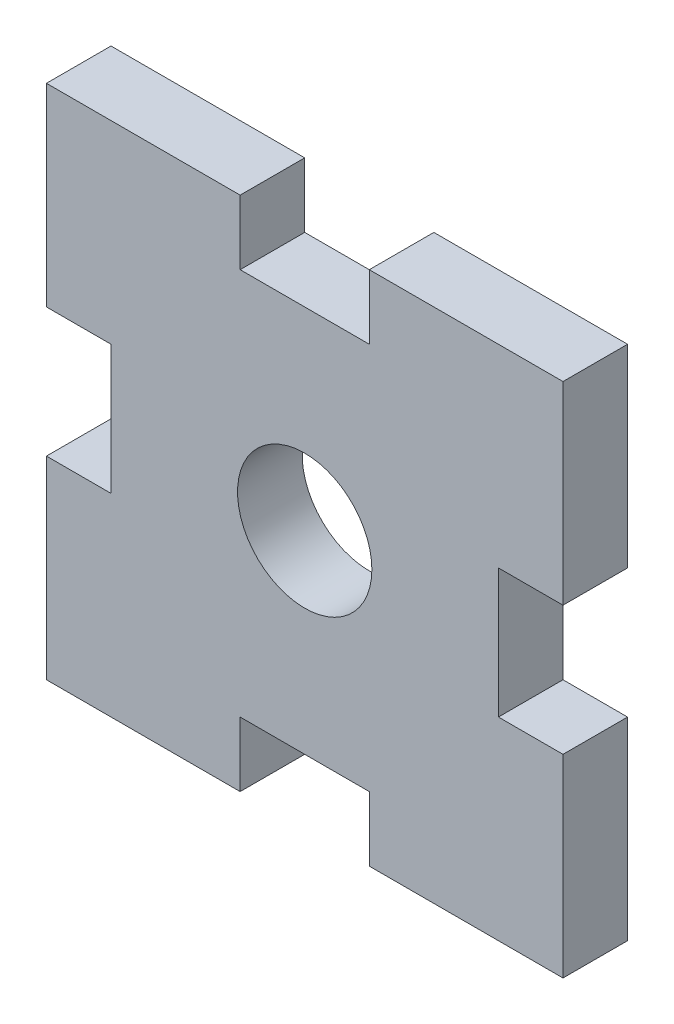
ISO-10303-21;
HEADER;
FILE_DESCRIPTION(('STEP AP214'),'2;1');
FILE_NAME('part.step','',(''),(''),'','','');
FILE_SCHEMA(('AUTOMOTIVE_DESIGN { 1 0 10303 214 1 1 1 1 }'));
ENDSEC;
DATA;
#1=APPLICATION_CONTEXT('core data for automotive mechanical design processes');
#2=APPLICATION_PROTOCOL_DEFINITION('international standard','automotive_design',2000,#1);
#3=PRODUCT_CONTEXT('',#1,'mechanical');
#4=PRODUCT('Part','Part','',(#3));
#5=PRODUCT_RELATED_PRODUCT_CATEGORY('part','',(#4));
#6=PRODUCT_DEFINITION_FORMATION('','',#4);
#7=PRODUCT_DEFINITION_CONTEXT('part definition',#1,'design');
#8=PRODUCT_DEFINITION('design','',#6,#7);
#9=PRODUCT_DEFINITION_SHAPE('','',#8);
#10=(LENGTH_UNIT() NAMED_UNIT(*) SI_UNIT(.MILLI.,.METRE.));
#11=(NAMED_UNIT(*) PLANE_ANGLE_UNIT() SI_UNIT($,.RADIAN.));
#12=(NAMED_UNIT(*) SI_UNIT($,.STERADIAN.) SOLID_ANGLE_UNIT());
#13=UNCERTAINTY_MEASURE_WITH_UNIT(LENGTH_MEASURE(1.E-05),#10,'distance_accuracy_value','');
#14=(GEOMETRIC_REPRESENTATION_CONTEXT(3) GLOBAL_UNCERTAINTY_ASSIGNED_CONTEXT((#13)) GLOBAL_UNIT_ASSIGNED_CONTEXT((#10,
#11,#12)) REPRESENTATION_CONTEXT('',''));
#15=CARTESIAN_POINT('',(0.,0.,0.));
#16=DIRECTION('',(0.,0.,1.));
#17=DIRECTION('',(1.,0.,0.));
#18=AXIS2_PLACEMENT_3D('',#15,#16,#17);
#19=CARTESIAN_POINT('',(-12.7,9.525,3.175));
#20=DIRECTION('',(0.,0.,1.));
#21=DIRECTION('',(1.,0.,0.));
#22=AXIS2_PLACEMENT_3D('',#19,#20,#21);
#23=PLANE('',#22);
#24=DIRECTION('',(0.,-1.,0.));
#25=VECTOR('',#24,1.);
#26=CARTESIAN_POINT('',(-12.7,12.7,3.175));
#27=LINE('',#26,#25);
#28=CARTESIAN_POINT('',(-12.7,12.7,3.175));
#29=VERTEX_POINT('',#28);
#30=CARTESIAN_POINT('',(-12.7,3.175,3.175));
#31=VERTEX_POINT('',#30);
#32=EDGE_CURVE('E241',#29,#31,#27,.T.);
#33=ORIENTED_EDGE('',*,*,#32,.T.);
#34=DIRECTION('',(1.,0.,0.));
#35=VECTOR('',#34,1.);
#36=CARTESIAN_POINT('',(-12.7,3.175,3.175));
#37=LINE('',#36,#35);
#38=CARTESIAN_POINT('',(-9.525,3.175,3.175));
#39=VERTEX_POINT('',#38);
#40=EDGE_CURVE('E129',#31,#39,#37,.T.);
#41=ORIENTED_EDGE('',*,*,#40,.T.);
#42=DIRECTION('',(0.,-1.,0.));
#43=VECTOR('',#42,1.);
#44=CARTESIAN_POINT('',(-9.525,3.175,3.175));
#45=LINE('',#44,#43);
#46=CARTESIAN_POINT('',(-9.525,-3.175,3.175));
#47=VERTEX_POINT('',#46);
#48=EDGE_CURVE('E292',#39,#47,#45,.T.);
#49=ORIENTED_EDGE('',*,*,#48,.T.);
#50=DIRECTION('',(-1.,0.,0.));
#51=VECTOR('',#50,1.);
#52=CARTESIAN_POINT('',(-9.525,-3.175,3.175));
#53=LINE('',#52,#51);
#54=CARTESIAN_POINT('',(-12.7,-3.17500000000001,3.175));
#55=VERTEX_POINT('',#54);
#56=EDGE_CURVE('E311',#47,#55,#53,.T.);
#57=ORIENTED_EDGE('',*,*,#56,.T.);
#58=DIRECTION('',(0.,-1.,0.));
#59=VECTOR('',#58,1.);
#60=CARTESIAN_POINT('',(-12.7,-3.17500000000001,3.175));
#61=LINE('',#60,#59);
#62=CARTESIAN_POINT('',(-12.7,-12.7,3.175));
#63=VERTEX_POINT('',#62);
#64=EDGE_CURVE('E308',#55,#63,#61,.T.);
#65=ORIENTED_EDGE('',*,*,#64,.T.);
#66=DIRECTION('',(1.,0.,0.));
#67=VECTOR('',#66,1.);
#68=CARTESIAN_POINT('',(-12.7,-12.7,3.175));
#69=LINE('',#68,#67);
#70=CARTESIAN_POINT('',(-3.17499999999999,-12.7,3.175));
#71=VERTEX_POINT('',#70);
#72=EDGE_CURVE('E310',#63,#71,#69,.T.);
#73=ORIENTED_EDGE('',*,*,#72,.T.);
#74=DIRECTION('',(0.,1.,0.));
#75=VECTOR('',#74,1.);
#76=CARTESIAN_POINT('',(-3.17499999999999,-12.7,3.175));
#77=LINE('',#76,#75);
#78=CARTESIAN_POINT('',(-3.17499999999999,-9.525,3.175));
#79=VERTEX_POINT('',#78);
#80=EDGE_CURVE('E313',#71,#79,#77,.T.);
#81=ORIENTED_EDGE('',*,*,#80,.T.);
#82=DIRECTION('',(1.,0.,0.));
#83=VECTOR('',#82,1.);
#84=CARTESIAN_POINT('',(-3.17499999999999,-9.525,3.175));
#85=LINE('',#84,#83);
#86=CARTESIAN_POINT('',(3.17500000000001,-9.525,3.175));
#87=VERTEX_POINT('',#86);
#88=EDGE_CURVE('E319',#79,#87,#85,.T.);
#89=ORIENTED_EDGE('',*,*,#88,.T.);
#90=DIRECTION('',(0.,-1.,0.));
#91=VECTOR('',#90,1.);
#92=CARTESIAN_POINT('',(3.17500000000001,-9.525,3.175));
#93=LINE('',#92,#91);
#94=CARTESIAN_POINT('',(3.17500000000001,-12.7,3.175));
#95=VERTEX_POINT('',#94);
#96=EDGE_CURVE('E321',#87,#95,#93,.T.);
#97=ORIENTED_EDGE('',*,*,#96,.T.);
#98=DIRECTION('',(1.,0.,0.));
#99=VECTOR('',#98,1.);
#100=CARTESIAN_POINT('',(3.17500000000001,-12.7,3.175));
#101=LINE('',#100,#99);
#102=CARTESIAN_POINT('',(12.7,-12.7,3.175));
#103=VERTEX_POINT('',#102);
#104=EDGE_CURVE('E323',#95,#103,#101,.T.);
#105=ORIENTED_EDGE('',*,*,#104,.T.);
#106=DIRECTION('',(0.,1.,0.));
#107=VECTOR('',#106,1.);
#108=CARTESIAN_POINT('',(12.7,-12.7,3.175));
#109=LINE('',#108,#107);
#110=CARTESIAN_POINT('',(12.7,-3.175,3.175));
#111=VERTEX_POINT('',#110);
#112=EDGE_CURVE('E325',#103,#111,#109,.T.);
#113=ORIENTED_EDGE('',*,*,#112,.T.);
#114=DIRECTION('',(-1.,0.,0.));
#115=VECTOR('',#114,1.);
#116=CARTESIAN_POINT('',(9.52499999999999,-3.175,3.175));
#117=LINE('',#116,#115);
#118=CARTESIAN_POINT('',(9.52499999999999,-3.175,3.175));
#119=VERTEX_POINT('',#118);
#120=EDGE_CURVE('E327',#111,#119,#117,.T.);
#121=ORIENTED_EDGE('',*,*,#120,.T.);
#122=DIRECTION('',(0.,1.,0.));
#123=VECTOR('',#122,1.);
#124=CARTESIAN_POINT('',(9.52499999999999,3.175,3.175));
#125=LINE('',#124,#123);
#126=CARTESIAN_POINT('',(9.52499999999999,3.175,3.175));
#127=VERTEX_POINT('',#126);
#128=EDGE_CURVE('E329',#119,#127,#125,.T.);
#129=ORIENTED_EDGE('',*,*,#128,.T.);
#130=DIRECTION('',(1.,0.,0.));
#131=VECTOR('',#130,1.);
#132=CARTESIAN_POINT('',(12.7,3.175,3.175));
#133=LINE('',#132,#131);
#134=CARTESIAN_POINT('',(12.7,3.175,3.175));
#135=VERTEX_POINT('',#134);
#136=EDGE_CURVE('E331',#127,#135,#133,.T.);
#137=ORIENTED_EDGE('',*,*,#136,.T.);
#138=DIRECTION('',(0.,1.,0.));
#139=VECTOR('',#138,1.);
#140=CARTESIAN_POINT('',(12.7,12.7,3.175));
#141=LINE('',#140,#139);
#142=CARTESIAN_POINT('',(12.7,12.7,3.175));
#143=VERTEX_POINT('',#142);
#144=EDGE_CURVE('E333',#135,#143,#141,.T.);
#145=ORIENTED_EDGE('',*,*,#144,.T.);
#146=DIRECTION('',(-1.,0.,0.));
#147=VECTOR('',#146,1.);
#148=CARTESIAN_POINT('',(12.7,12.7,3.175));
#149=LINE('',#148,#147);
#150=CARTESIAN_POINT('',(3.175,12.7,3.175));
#151=VERTEX_POINT('',#150);
#152=EDGE_CURVE('E335',#143,#151,#149,.T.);
#153=ORIENTED_EDGE('',*,*,#152,.T.);
#154=DIRECTION('',(0.,-1.,0.));
#155=VECTOR('',#154,1.);
#156=CARTESIAN_POINT('',(3.175,9.525,3.175));
#157=LINE('',#156,#155);
#158=CARTESIAN_POINT('',(3.175,9.525,3.175));
#159=VERTEX_POINT('',#158);
#160=EDGE_CURVE('E184',#151,#159,#157,.T.);
#161=ORIENTED_EDGE('',*,*,#160,.T.);
#162=DIRECTION('',(-1.,0.,0.));
#163=VECTOR('',#162,1.);
#164=CARTESIAN_POINT('',(-3.175,9.525,3.175));
#165=LINE('',#164,#163);
#166=CARTESIAN_POINT('',(-3.175,9.525,3.175));
#167=VERTEX_POINT('',#166);
#168=EDGE_CURVE('E178',#159,#167,#165,.T.);
#169=ORIENTED_EDGE('',*,*,#168,.T.);
#170=DIRECTION('',(0.,1.,0.));
#171=VECTOR('',#170,1.);
#172=CARTESIAN_POINT('',(-3.175,12.7,3.175));
#173=LINE('',#172,#171);
#174=CARTESIAN_POINT('',(-3.175,12.7,3.175));
#175=VERTEX_POINT('',#174);
#176=EDGE_CURVE('E182',#167,#175,#173,.T.);
#177=ORIENTED_EDGE('',*,*,#176,.T.);
#178=DIRECTION('',(-1.,0.,0.));
#179=VECTOR('',#178,1.);
#180=CARTESIAN_POINT('',(-12.7,12.7,3.175));
#181=LINE('',#180,#179);
#182=EDGE_CURVE('E50',#175,#29,#181,.T.);
#183=ORIENTED_EDGE('',*,*,#182,.T.);
#184=EDGE_LOOP('',(#33,#41,#49,#57,#65,#73,#81,#89,#97,#105,#113,#121,#129,#137,#145,#153,#161,
#169,#177,#183));
#185=FACE_BOUND('',#184,.T.);
#186=CARTESIAN_POINT('',(0.,0.,3.175));
#187=DIRECTION('',(0.,0.,1.));
#188=DIRECTION('',(1.,0.,0.));
#189=AXIS2_PLACEMENT_3D('',#186,#187,#188);
#190=CIRCLE('',#189,3.302);
#191=CARTESIAN_POINT('',(3.302,0.,3.175));
#192=VERTEX_POINT('',#191);
#193=EDGE_CURVE('E206',#192,#192,#190,.T.);
#194=ORIENTED_EDGE('',*,*,#193,.F.);
#195=EDGE_LOOP('',(#194));
#196=FACE_BOUND('',#195,.T.);
#197=ADVANCED_FACE('F33',(#185,#196),#23,.T.);
#198=CARTESIAN_POINT('',(-12.7,9.525,0.));
#199=DIRECTION('',(0.,0.,1.));
#200=DIRECTION('',(1.,0.,0.));
#201=AXIS2_PLACEMENT_3D('',#198,#199,#200);
#202=PLANE('',#201);
#203=DIRECTION('',(0.,-1.,0.));
#204=VECTOR('',#203,1.);
#205=CARTESIAN_POINT('',(-12.7,12.7,0.));
#206=LINE('',#205,#204);
#207=CARTESIAN_POINT('',(-12.7,12.7,0.));
#208=VERTEX_POINT('',#207);
#209=CARTESIAN_POINT('',(-12.7,3.175,0.));
#210=VERTEX_POINT('',#209);
#211=EDGE_CURVE('E202',#208,#210,#206,.T.);
#212=ORIENTED_EDGE('',*,*,#211,.F.);
#213=DIRECTION('',(-1.,0.,0.));
#214=VECTOR('',#213,1.);
#215=CARTESIAN_POINT('',(-12.7,12.7,0.));
#216=LINE('',#215,#214);
#217=CARTESIAN_POINT('',(-3.175,12.7,0.));
#218=VERTEX_POINT('',#217);
#219=EDGE_CURVE('E121',#218,#208,#216,.T.);
#220=ORIENTED_EDGE('',*,*,#219,.F.);
#221=DIRECTION('',(0.,1.,0.));
#222=VECTOR('',#221,1.);
#223=CARTESIAN_POINT('',(-3.175,12.7,0.));
#224=LINE('',#223,#222);
#225=CARTESIAN_POINT('',(-3.175,9.525,0.));
#226=VERTEX_POINT('',#225);
#227=EDGE_CURVE('E115',#226,#218,#224,.T.);
#228=ORIENTED_EDGE('',*,*,#227,.F.);
#229=DIRECTION('',(-1.,0.,0.));
#230=VECTOR('',#229,1.);
#231=CARTESIAN_POINT('',(-3.175,9.525,0.));
#232=LINE('',#231,#230);
#233=CARTESIAN_POINT('',(3.175,9.525,0.));
#234=VERTEX_POINT('',#233);
#235=EDGE_CURVE('E192',#234,#226,#232,.T.);
#236=ORIENTED_EDGE('',*,*,#235,.F.);
#237=DIRECTION('',(0.,-1.,0.));
#238=VECTOR('',#237,1.);
#239=CARTESIAN_POINT('',(3.175,9.525,0.));
#240=LINE('',#239,#238);
#241=CARTESIAN_POINT('',(3.175,12.7,0.));
#242=VERTEX_POINT('',#241);
#243=EDGE_CURVE('E236',#242,#234,#240,.T.);
#244=ORIENTED_EDGE('',*,*,#243,.F.);
#245=DIRECTION('',(-1.,0.,0.));
#246=VECTOR('',#245,1.);
#247=CARTESIAN_POINT('',(12.7,12.7,0.));
#248=LINE('',#247,#246);
#249=CARTESIAN_POINT('',(12.7,12.7,0.));
#250=VERTEX_POINT('',#249);
#251=EDGE_CURVE('E234',#250,#242,#248,.T.);
#252=ORIENTED_EDGE('',*,*,#251,.F.);
#253=DIRECTION('',(0.,1.,0.));
#254=VECTOR('',#253,1.);
#255=CARTESIAN_POINT('',(12.7,12.7,0.));
#256=LINE('',#255,#254);
#257=CARTESIAN_POINT('',(12.7,3.175,0.));
#258=VERTEX_POINT('',#257);
#259=EDGE_CURVE('E232',#258,#250,#256,.T.);
#260=ORIENTED_EDGE('',*,*,#259,.F.);
#261=DIRECTION('',(1.,0.,0.));
#262=VECTOR('',#261,1.);
#263=CARTESIAN_POINT('',(12.7,3.175,0.));
#264=LINE('',#263,#262);
#265=CARTESIAN_POINT('',(9.52499999999999,3.175,0.));
#266=VERTEX_POINT('',#265);
#267=EDGE_CURVE('E230',#266,#258,#264,.T.);
#268=ORIENTED_EDGE('',*,*,#267,.F.);
#269=DIRECTION('',(0.,1.,0.));
#270=VECTOR('',#269,1.);
#271=CARTESIAN_POINT('',(9.52499999999999,3.175,0.));
#272=LINE('',#271,#270);
#273=CARTESIAN_POINT('',(9.52499999999999,-3.175,0.));
#274=VERTEX_POINT('',#273);
#275=EDGE_CURVE('E228',#274,#266,#272,.T.);
#276=ORIENTED_EDGE('',*,*,#275,.F.);
#277=DIRECTION('',(-1.,0.,0.));
#278=VECTOR('',#277,1.);
#279=CARTESIAN_POINT('',(9.52499999999999,-3.175,0.));
#280=LINE('',#279,#278);
#281=CARTESIAN_POINT('',(12.7,-3.175,0.));
#282=VERTEX_POINT('',#281);
#283=EDGE_CURVE('E226',#282,#274,#280,.T.);
#284=ORIENTED_EDGE('',*,*,#283,.F.);
#285=DIRECTION('',(0.,1.,0.));
#286=VECTOR('',#285,1.);
#287=CARTESIAN_POINT('',(12.7,-12.7,0.));
#288=LINE('',#287,#286);
#289=CARTESIAN_POINT('',(12.7,-12.7,0.));
#290=VERTEX_POINT('',#289);
#291=EDGE_CURVE('E224',#290,#282,#288,.T.);
#292=ORIENTED_EDGE('',*,*,#291,.F.);
#293=DIRECTION('',(1.,0.,0.));
#294=VECTOR('',#293,1.);
#295=CARTESIAN_POINT('',(3.17500000000001,-12.7,0.));
#296=LINE('',#295,#294);
#297=CARTESIAN_POINT('',(3.17500000000001,-12.7,0.));
#298=VERTEX_POINT('',#297);
#299=EDGE_CURVE('E222',#298,#290,#296,.T.);
#300=ORIENTED_EDGE('',*,*,#299,.F.);
#301=DIRECTION('',(0.,-1.,0.));
#302=VECTOR('',#301,1.);
#303=CARTESIAN_POINT('',(3.17500000000001,-9.525,0.));
#304=LINE('',#303,#302);
#305=CARTESIAN_POINT('',(3.17500000000001,-9.525,0.));
#306=VERTEX_POINT('',#305);
#307=EDGE_CURVE('E220',#306,#298,#304,.T.);
#308=ORIENTED_EDGE('',*,*,#307,.F.);
#309=DIRECTION('',(1.,0.,0.));
#310=VECTOR('',#309,1.);
#311=CARTESIAN_POINT('',(-3.17499999999999,-9.525,0.));
#312=LINE('',#311,#310);
#313=CARTESIAN_POINT('',(-3.17499999999999,-9.525,0.));
#314=VERTEX_POINT('',#313);
#315=EDGE_CURVE('E218',#314,#306,#312,.T.);
#316=ORIENTED_EDGE('',*,*,#315,.F.);
#317=DIRECTION('',(0.,1.,0.));
#318=VECTOR('',#317,1.);
#319=CARTESIAN_POINT('',(-3.17499999999999,-12.7,0.));
#320=LINE('',#319,#318);
#321=CARTESIAN_POINT('',(-3.17499999999999,-12.7,0.));
#322=VERTEX_POINT('',#321);
#323=EDGE_CURVE('E216',#322,#314,#320,.T.);
#324=ORIENTED_EDGE('',*,*,#323,.F.);
#325=DIRECTION('',(1.,0.,0.));
#326=VECTOR('',#325,1.);
#327=CARTESIAN_POINT('',(-12.7,-12.7,0.));
#328=LINE('',#327,#326);
#329=CARTESIAN_POINT('',(-12.7,-12.7,0.));
#330=VERTEX_POINT('',#329);
#331=EDGE_CURVE('E214',#330,#322,#328,.T.);
#332=ORIENTED_EDGE('',*,*,#331,.F.);
#333=DIRECTION('',(0.,-1.,0.));
#334=VECTOR('',#333,1.);
#335=CARTESIAN_POINT('',(-12.7,-3.17500000000001,0.));
#336=LINE('',#335,#334);
#337=CARTESIAN_POINT('',(-12.7,-3.17500000000001,0.));
#338=VERTEX_POINT('',#337);
#339=EDGE_CURVE('E212',#338,#330,#336,.T.);
#340=ORIENTED_EDGE('',*,*,#339,.F.);
#341=DIRECTION('',(-1.,0.,0.));
#342=VECTOR('',#341,1.);
#343=CARTESIAN_POINT('',(-9.525,-3.175,0.));
#344=LINE('',#343,#342);
#345=CARTESIAN_POINT('',(-9.525,-3.175,0.));
#346=VERTEX_POINT('',#345);
#347=EDGE_CURVE('E210',#346,#338,#344,.T.);
#348=ORIENTED_EDGE('',*,*,#347,.F.);
#349=DIRECTION('',(0.,-1.,0.));
#350=VECTOR('',#349,1.);
#351=CARTESIAN_POINT('',(-9.525,3.175,0.));
#352=LINE('',#351,#350);
#353=CARTESIAN_POINT('',(-9.525,3.175,0.));
#354=VERTEX_POINT('',#353);
#355=EDGE_CURVE('E208',#354,#346,#352,.T.);
#356=ORIENTED_EDGE('',*,*,#355,.F.);
#357=DIRECTION('',(1.,0.,0.));
#358=VECTOR('',#357,1.);
#359=CARTESIAN_POINT('',(-12.7,3.175,0.));
#360=LINE('',#359,#358);
#361=EDGE_CURVE('E205',#210,#354,#360,.T.);
#362=ORIENTED_EDGE('',*,*,#361,.F.);
#363=EDGE_LOOP('',(#212,#220,#228,#236,#244,#252,#260,#268,#276,#284,#292,#300,#308,#316,#324,
#332,#340,#348,#356,#362));
#364=FACE_BOUND('',#363,.T.);
#365=CARTESIAN_POINT('',(0.,0.,0.));
#366=DIRECTION('',(0.,0.,1.));
#367=DIRECTION('',(1.,0.,0.));
#368=AXIS2_PLACEMENT_3D('',#365,#366,#367);
#369=CIRCLE('',#368,3.302);
#370=CARTESIAN_POINT('',(3.302,0.,0.));
#371=VERTEX_POINT('',#370);
#372=EDGE_CURVE('E586',#371,#371,#369,.T.);
#373=ORIENTED_EDGE('',*,*,#372,.T.);
#374=EDGE_LOOP('',(#373));
#375=FACE_BOUND('',#374,.T.);
#376=ADVANCED_FACE('F296',(#364,#375),#202,.F.);
#377=CARTESIAN_POINT('',(-12.7,12.7,3.175));
#378=DIRECTION('',(1.,0.,0.));
#379=DIRECTION('',(0.,1.,0.));
#380=AXIS2_PLACEMENT_3D('',#377,#378,#379);
#381=PLANE('',#380);
#382=ORIENTED_EDGE('',*,*,#211,.T.);
#383=DIRECTION('',(0.,0.,-1.));
#384=VECTOR('',#383,1.);
#385=CARTESIAN_POINT('',(-12.7,3.175,3.175));
#386=LINE('',#385,#384);
#387=EDGE_CURVE('E11',#31,#210,#386,.T.);
#388=ORIENTED_EDGE('',*,*,#387,.F.);
#389=ORIENTED_EDGE('',*,*,#32,.F.);
#390=DIRECTION('',(0.,0.,-1.));
#391=VECTOR('',#390,1.);
#392=CARTESIAN_POINT('',(-12.7,12.7,3.175));
#393=LINE('',#392,#391);
#394=EDGE_CURVE('E198',#29,#208,#393,.T.);
#395=ORIENTED_EDGE('',*,*,#394,.T.);
#396=EDGE_LOOP('',(#382,#388,#389,#395));
#397=FACE_BOUND('',#396,.T.);
#398=ADVANCED_FACE('F35',(#397),#381,.F.);
#399=CARTESIAN_POINT('',(-12.7,3.175,3.175));
#400=DIRECTION('',(0.,1.,0.));
#401=DIRECTION('',(0.,0.,1.));
#402=AXIS2_PLACEMENT_3D('',#399,#400,#401);
#403=PLANE('',#402);
#404=ORIENTED_EDGE('',*,*,#361,.T.);
#405=DIRECTION('',(0.,0.,-1.));
#406=VECTOR('',#405,1.);
#407=CARTESIAN_POINT('',(-9.525,3.175,3.175));
#408=LINE('',#407,#406);
#409=EDGE_CURVE('E42',#39,#354,#408,.T.);
#410=ORIENTED_EDGE('',*,*,#409,.F.);
#411=ORIENTED_EDGE('',*,*,#40,.F.);
#412=ORIENTED_EDGE('',*,*,#387,.T.);
#413=EDGE_LOOP('',(#404,#410,#411,#412));
#414=FACE_BOUND('',#413,.T.);
#415=ADVANCED_FACE('F369',(#414),#403,.F.);
#416=CARTESIAN_POINT('',(-9.525,3.175,3.175));
#417=DIRECTION('',(1.,0.,0.));
#418=DIRECTION('',(0.,0.,-1.));
#419=AXIS2_PLACEMENT_3D('',#416,#417,#418);
#420=PLANE('',#419);
#421=ORIENTED_EDGE('',*,*,#355,.T.);
#422=DIRECTION('',(0.,0.,-1.));
#423=VECTOR('',#422,1.);
#424=CARTESIAN_POINT('',(-9.525,-3.175,3.175));
#425=LINE('',#424,#423);
#426=EDGE_CURVE('E284',#47,#346,#425,.T.);
#427=ORIENTED_EDGE('',*,*,#426,.F.);
#428=ORIENTED_EDGE('',*,*,#48,.F.);
#429=ORIENTED_EDGE('',*,*,#409,.T.);
#430=EDGE_LOOP('',(#421,#427,#428,#429));
#431=FACE_BOUND('',#430,.T.);
#432=ADVANCED_FACE('F290',(#431),#420,.F.);
#433=CARTESIAN_POINT('',(-9.525,-3.175,3.175));
#434=DIRECTION('',(0.,-1.,0.));
#435=DIRECTION('',(1.,0.,0.));
#436=AXIS2_PLACEMENT_3D('',#433,#434,#435);
#437=PLANE('',#436);
#438=ORIENTED_EDGE('',*,*,#347,.T.);
#439=DIRECTION('',(0.,0.,-1.));
#440=VECTOR('',#439,1.);
#441=CARTESIAN_POINT('',(-12.7,-3.17500000000001,3.175));
#442=LINE('',#441,#440);
#443=EDGE_CURVE('E281',#55,#338,#442,.T.);
#444=ORIENTED_EDGE('',*,*,#443,.F.);
#445=ORIENTED_EDGE('',*,*,#56,.F.);
#446=ORIENTED_EDGE('',*,*,#426,.T.);
#447=EDGE_LOOP('',(#438,#444,#445,#446));
#448=FACE_BOUND('',#447,.T.);
#449=ADVANCED_FACE('F302',(#448),#437,.F.);
#450=CARTESIAN_POINT('',(-12.7,-3.17500000000001,3.175));
#451=DIRECTION('',(1.,0.,0.));
#452=DIRECTION('',(0.,1.,0.));
#453=AXIS2_PLACEMENT_3D('',#450,#451,#452);
#454=PLANE('',#453);
#455=ORIENTED_EDGE('',*,*,#339,.T.);
#456=DIRECTION('',(0.,0.,-1.));
#457=VECTOR('',#456,1.);
#458=CARTESIAN_POINT('',(-12.7,-12.7,3.175));
#459=LINE('',#458,#457);
#460=EDGE_CURVE('E278',#63,#330,#459,.T.);
#461=ORIENTED_EDGE('',*,*,#460,.F.);
#462=ORIENTED_EDGE('',*,*,#64,.F.);
#463=ORIENTED_EDGE('',*,*,#443,.T.);
#464=EDGE_LOOP('',(#455,#461,#462,#463));
#465=FACE_BOUND('',#464,.T.);
#466=ADVANCED_FACE('F306',(#465),#454,.F.);
#467=CARTESIAN_POINT('',(-12.7,-12.7,3.175));
#468=DIRECTION('',(0.,1.,0.));
#469=DIRECTION('',(0.,0.,1.));
#470=AXIS2_PLACEMENT_3D('',#467,#468,#469);
#471=PLANE('',#470);
#472=ORIENTED_EDGE('',*,*,#331,.T.);
#473=DIRECTION('',(0.,0.,-1.));
#474=VECTOR('',#473,1.);
#475=CARTESIAN_POINT('',(-3.17499999999999,-12.7,3.175));
#476=LINE('',#475,#474);
#477=EDGE_CURVE('E275',#71,#322,#476,.T.);
#478=ORIENTED_EDGE('',*,*,#477,.F.);
#479=ORIENTED_EDGE('',*,*,#72,.F.);
#480=ORIENTED_EDGE('',*,*,#460,.T.);
#481=EDGE_LOOP('',(#472,#478,#479,#480));
#482=FACE_BOUND('',#481,.T.);
#483=ADVANCED_FACE('F382',(#482),#471,.F.);
#484=CARTESIAN_POINT('',(-3.17499999999999,-12.7,3.175));
#485=DIRECTION('',(-1.,0.,0.));
#486=DIRECTION('',(0.,0.,1.));
#487=AXIS2_PLACEMENT_3D('',#484,#485,#486);
#488=PLANE('',#487);
#489=ORIENTED_EDGE('',*,*,#323,.T.);
#490=DIRECTION('',(0.,0.,-1.));
#491=VECTOR('',#490,1.);
#492=CARTESIAN_POINT('',(-3.17499999999999,-9.525,3.175));
#493=LINE('',#492,#491);
#494=EDGE_CURVE('E272',#79,#314,#493,.T.);
#495=ORIENTED_EDGE('',*,*,#494,.F.);
#496=ORIENTED_EDGE('',*,*,#80,.F.);
#497=ORIENTED_EDGE('',*,*,#477,.T.);
#498=EDGE_LOOP('',(#489,#495,#496,#497));
#499=FACE_BOUND('',#498,.T.);
#500=ADVANCED_FACE('F385',(#499),#488,.F.);
#501=CARTESIAN_POINT('',(-3.17499999999999,-9.525,3.175));
#502=DIRECTION('',(0.,1.,0.));
#503=DIRECTION('',(0.,0.,1.));
#504=AXIS2_PLACEMENT_3D('',#501,#502,#503);
#505=PLANE('',#504);
#506=ORIENTED_EDGE('',*,*,#315,.T.);
#507=DIRECTION('',(0.,0.,-1.));
#508=VECTOR('',#507,1.);
#509=CARTESIAN_POINT('',(3.17500000000001,-9.525,3.175));
#510=LINE('',#509,#508);
#511=EDGE_CURVE('E269',#87,#306,#510,.T.);
#512=ORIENTED_EDGE('',*,*,#511,.F.);
#513=ORIENTED_EDGE('',*,*,#88,.F.);
#514=ORIENTED_EDGE('',*,*,#494,.T.);
#515=EDGE_LOOP('',(#506,#512,#513,#514));
#516=FACE_BOUND('',#515,.T.);
#517=ADVANCED_FACE('F389',(#516),#505,.F.);
#518=CARTESIAN_POINT('',(3.17500000000001,-9.525,3.175));
#519=DIRECTION('',(1.,0.,0.));
#520=DIRECTION('',(0.,1.,0.));
#521=AXIS2_PLACEMENT_3D('',#518,#519,#520);
#522=PLANE('',#521);
#523=ORIENTED_EDGE('',*,*,#307,.T.);
#524=DIRECTION('',(0.,0.,-1.));
#525=VECTOR('',#524,1.);
#526=CARTESIAN_POINT('',(3.17500000000001,-12.7,3.175));
#527=LINE('',#526,#525);
#528=EDGE_CURVE('E266',#95,#298,#527,.T.);
#529=ORIENTED_EDGE('',*,*,#528,.F.);
#530=ORIENTED_EDGE('',*,*,#96,.F.);
#531=ORIENTED_EDGE('',*,*,#511,.T.);
#532=EDGE_LOOP('',(#523,#529,#530,#531));
#533=FACE_BOUND('',#532,.T.);
#534=ADVANCED_FACE('F393',(#533),#522,.F.);
#535=CARTESIAN_POINT('',(3.17500000000001,-12.7,3.175));
#536=DIRECTION('',(0.,1.,0.));
#537=DIRECTION('',(0.,0.,1.));
#538=AXIS2_PLACEMENT_3D('',#535,#536,#537);
#539=PLANE('',#538);
#540=ORIENTED_EDGE('',*,*,#299,.T.);
#541=DIRECTION('',(0.,0.,-1.));
#542=VECTOR('',#541,1.);
#543=CARTESIAN_POINT('',(12.7,-12.7,3.175));
#544=LINE('',#543,#542);
#545=EDGE_CURVE('E263',#103,#290,#544,.T.);
#546=ORIENTED_EDGE('',*,*,#545,.F.);
#547=ORIENTED_EDGE('',*,*,#104,.F.);
#548=ORIENTED_EDGE('',*,*,#528,.T.);
#549=EDGE_LOOP('',(#540,#546,#547,#548));
#550=FACE_BOUND('',#549,.T.);
#551=ADVANCED_FACE('F397',(#550),#539,.F.);
#552=CARTESIAN_POINT('',(12.7,-12.7,3.175));
#553=DIRECTION('',(-1.,0.,0.));
#554=DIRECTION('',(0.,-1.,0.));
#555=AXIS2_PLACEMENT_3D('',#552,#553,#554);
#556=PLANE('',#555);
#557=ORIENTED_EDGE('',*,*,#291,.T.);
#558=DIRECTION('',(0.,0.,-1.));
#559=VECTOR('',#558,1.);
#560=CARTESIAN_POINT('',(12.7,-3.175,3.175));
#561=LINE('',#560,#559);
#562=EDGE_CURVE('E260',#111,#282,#561,.T.);
#563=ORIENTED_EDGE('',*,*,#562,.F.);
#564=ORIENTED_EDGE('',*,*,#112,.F.);
#565=ORIENTED_EDGE('',*,*,#545,.T.);
#566=EDGE_LOOP('',(#557,#563,#564,#565));
#567=FACE_BOUND('',#566,.T.);
#568=ADVANCED_FACE('F401',(#567),#556,.F.);
#569=CARTESIAN_POINT('',(9.52499999999999,-3.175,3.175));
#570=DIRECTION('',(0.,-1.,0.));
#571=DIRECTION('',(1.,0.,0.));
#572=AXIS2_PLACEMENT_3D('',#569,#570,#571);
#573=PLANE('',#572);
#574=ORIENTED_EDGE('',*,*,#283,.T.);
#575=DIRECTION('',(0.,0.,-1.));
#576=VECTOR('',#575,1.);
#577=CARTESIAN_POINT('',(9.52499999999999,-3.175,3.175));
#578=LINE('',#577,#576);
#579=EDGE_CURVE('E257',#119,#274,#578,.T.);
#580=ORIENTED_EDGE('',*,*,#579,.F.);
#581=ORIENTED_EDGE('',*,*,#120,.F.);
#582=ORIENTED_EDGE('',*,*,#562,.T.);
#583=EDGE_LOOP('',(#574,#580,#581,#582));
#584=FACE_BOUND('',#583,.T.);
#585=ADVANCED_FACE('F405',(#584),#573,.F.);
#586=CARTESIAN_POINT('',(9.52499999999999,3.175,3.175));
#587=DIRECTION('',(-1.,0.,0.));
#588=DIRECTION('',(0.,0.,1.));
#589=AXIS2_PLACEMENT_3D('',#586,#587,#588);
#590=PLANE('',#589);
#591=ORIENTED_EDGE('',*,*,#275,.T.);
#592=DIRECTION('',(0.,0.,-1.));
#593=VECTOR('',#592,1.);
#594=CARTESIAN_POINT('',(9.52499999999999,3.175,3.175));
#595=LINE('',#594,#593);
#596=EDGE_CURVE('E254',#127,#266,#595,.T.);
#597=ORIENTED_EDGE('',*,*,#596,.F.);
#598=ORIENTED_EDGE('',*,*,#128,.F.);
#599=ORIENTED_EDGE('',*,*,#579,.T.);
#600=EDGE_LOOP('',(#591,#597,#598,#599));
#601=FACE_BOUND('',#600,.T.);
#602=ADVANCED_FACE('F409',(#601),#590,.F.);
#603=CARTESIAN_POINT('',(12.7,3.175,3.175));
#604=DIRECTION('',(0.,1.,0.));
#605=DIRECTION('',(0.,0.,1.));
#606=AXIS2_PLACEMENT_3D('',#603,#604,#605);
#607=PLANE('',#606);
#608=ORIENTED_EDGE('',*,*,#267,.T.);
#609=DIRECTION('',(0.,0.,-1.));
#610=VECTOR('',#609,1.);
#611=CARTESIAN_POINT('',(12.7,3.175,3.175));
#612=LINE('',#611,#610);
#613=EDGE_CURVE('E251',#135,#258,#612,.T.);
#614=ORIENTED_EDGE('',*,*,#613,.F.);
#615=ORIENTED_EDGE('',*,*,#136,.F.);
#616=ORIENTED_EDGE('',*,*,#596,.T.);
#617=EDGE_LOOP('',(#608,#614,#615,#616));
#618=FACE_BOUND('',#617,.T.);
#619=ADVANCED_FACE('F413',(#618),#607,.F.);
#620=CARTESIAN_POINT('',(12.7,12.7,3.175));
#621=DIRECTION('',(-1.,0.,0.));
#622=DIRECTION('',(0.,-1.,0.));
#623=AXIS2_PLACEMENT_3D('',#620,#621,#622);
#624=PLANE('',#623);
#625=ORIENTED_EDGE('',*,*,#259,.T.);
#626=DIRECTION('',(0.,0.,-1.));
#627=VECTOR('',#626,1.);
#628=CARTESIAN_POINT('',(12.7,12.7,3.175));
#629=LINE('',#628,#627);
#630=EDGE_CURVE('E248',#143,#250,#629,.T.);
#631=ORIENTED_EDGE('',*,*,#630,.F.);
#632=ORIENTED_EDGE('',*,*,#144,.F.);
#633=ORIENTED_EDGE('',*,*,#613,.T.);
#634=EDGE_LOOP('',(#625,#631,#632,#633));
#635=FACE_BOUND('',#634,.T.);
#636=ADVANCED_FACE('F417',(#635),#624,.F.);
#637=CARTESIAN_POINT('',(12.7,12.7,3.175));
#638=DIRECTION('',(0.,-1.,0.));
#639=DIRECTION('',(0.,0.,-1.));
#640=AXIS2_PLACEMENT_3D('',#637,#638,#639);
#641=PLANE('',#640);
#642=ORIENTED_EDGE('',*,*,#251,.T.);
#643=DIRECTION('',(0.,0.,-1.));
#644=VECTOR('',#643,1.);
#645=CARTESIAN_POINT('',(3.175,12.7,3.175));
#646=LINE('',#645,#644);
#647=EDGE_CURVE('E245',#151,#242,#646,.T.);
#648=ORIENTED_EDGE('',*,*,#647,.F.);
#649=ORIENTED_EDGE('',*,*,#152,.F.);
#650=ORIENTED_EDGE('',*,*,#630,.T.);
#651=EDGE_LOOP('',(#642,#648,#649,#650));
#652=FACE_BOUND('',#651,.T.);
#653=ADVANCED_FACE('F341',(#652),#641,.F.);
#654=CARTESIAN_POINT('',(3.175,9.525,3.175));
#655=DIRECTION('',(1.,0.,0.));
#656=DIRECTION('',(0.,1.,0.));
#657=AXIS2_PLACEMENT_3D('',#654,#655,#656);
#658=PLANE('',#657);
#659=ORIENTED_EDGE('',*,*,#243,.T.);
#660=DIRECTION('',(0.,0.,-1.));
#661=VECTOR('',#660,1.);
#662=CARTESIAN_POINT('',(3.175,9.525,3.175));
#663=LINE('',#662,#661);
#664=EDGE_CURVE('E193',#159,#234,#663,.T.);
#665=ORIENTED_EDGE('',*,*,#664,.F.);
#666=ORIENTED_EDGE('',*,*,#160,.F.);
#667=ORIENTED_EDGE('',*,*,#647,.T.);
#668=EDGE_LOOP('',(#659,#665,#666,#667));
#669=FACE_BOUND('',#668,.T.);
#670=ADVANCED_FACE('F345',(#669),#658,.F.);
#671=CARTESIAN_POINT('',(-3.175,9.525,3.175));
#672=DIRECTION('',(0.,-1.,0.));
#673=DIRECTION('',(0.,0.,-1.));
#674=AXIS2_PLACEMENT_3D('',#671,#672,#673);
#675=PLANE('',#674);
#676=ORIENTED_EDGE('',*,*,#235,.T.);
#677=DIRECTION('',(0.,0.,-1.));
#678=VECTOR('',#677,1.);
#679=CARTESIAN_POINT('',(-3.175,9.525,3.175));
#680=LINE('',#679,#678);
#681=EDGE_CURVE('E189',#167,#226,#680,.T.);
#682=ORIENTED_EDGE('',*,*,#681,.F.);
#683=ORIENTED_EDGE('',*,*,#168,.F.);
#684=ORIENTED_EDGE('',*,*,#664,.T.);
#685=EDGE_LOOP('',(#676,#682,#683,#684));
#686=FACE_BOUND('',#685,.T.);
#687=ADVANCED_FACE('F190',(#686),#675,.F.);
#688=CARTESIAN_POINT('',(-3.175,12.7,3.175));
#689=DIRECTION('',(-1.,0.,0.));
#690=DIRECTION('',(0.,-1.,0.));
#691=AXIS2_PLACEMENT_3D('',#688,#689,#690);
#692=PLANE('',#691);
#693=ORIENTED_EDGE('',*,*,#227,.T.);
#694=DIRECTION('',(0.,0.,-1.));
#695=VECTOR('',#694,1.);
#696=CARTESIAN_POINT('',(-3.175,12.7,3.175));
#697=LINE('',#696,#695);
#698=EDGE_CURVE('E194',#175,#218,#697,.T.);
#699=ORIENTED_EDGE('',*,*,#698,.F.);
#700=ORIENTED_EDGE('',*,*,#176,.F.);
#701=ORIENTED_EDGE('',*,*,#681,.T.);
#702=EDGE_LOOP('',(#693,#699,#700,#701));
#703=FACE_BOUND('',#702,.T.);
#704=ADVANCED_FACE('F196',(#703),#692,.F.);
#705=CARTESIAN_POINT('',(-12.7,12.7,3.175));
#706=DIRECTION('',(0.,-1.,0.));
#707=DIRECTION('',(0.,0.,-1.));
#708=AXIS2_PLACEMENT_3D('',#705,#706,#707);
#709=PLANE('',#708);
#710=ORIENTED_EDGE('',*,*,#219,.T.);
#711=ORIENTED_EDGE('',*,*,#394,.F.);
#712=ORIENTED_EDGE('',*,*,#182,.F.);
#713=ORIENTED_EDGE('',*,*,#698,.T.);
#714=EDGE_LOOP('',(#710,#711,#712,#713));
#715=FACE_BOUND('',#714,.T.);
#716=ADVANCED_FACE('F349',(#715),#709,.F.);
#717=CARTESIAN_POINT('',(0.,0.,3.175));
#718=DIRECTION('',(0.,0.,-1.));
#719=DIRECTION('',(-1.,0.,0.));
#720=AXIS2_PLACEMENT_3D('',#717,#718,#719);
#721=CYLINDRICAL_SURFACE('',#720,3.302);
#722=ORIENTED_EDGE('',*,*,#193,.T.);
#723=EDGE_LOOP('',(#722));
#724=FACE_BOUND('',#723,.T.);
#725=ORIENTED_EDGE('',*,*,#372,.F.);
#726=EDGE_LOOP('',(#725));
#727=FACE_BOUND('',#726,.T.);
#728=ADVANCED_FACE('F351',(#724,#727),#721,.F.);
#729=CLOSED_SHELL('',(#197,#376,#398,#415,#432,#449,#466,#483,#500,#517,#534,#551,#568,#585,
#602,#619,#636,#653,#670,#687,#704,#716,#728));
#730=MANIFOLD_SOLID_BREP('B2',#729);
#731=ADVANCED_BREP_SHAPE_REPRESENTATION('',(#18,#730),#14);
#732=SHAPE_DEFINITION_REPRESENTATION(#9,#731);
ENDSEC;
END-ISO-10303-21;
